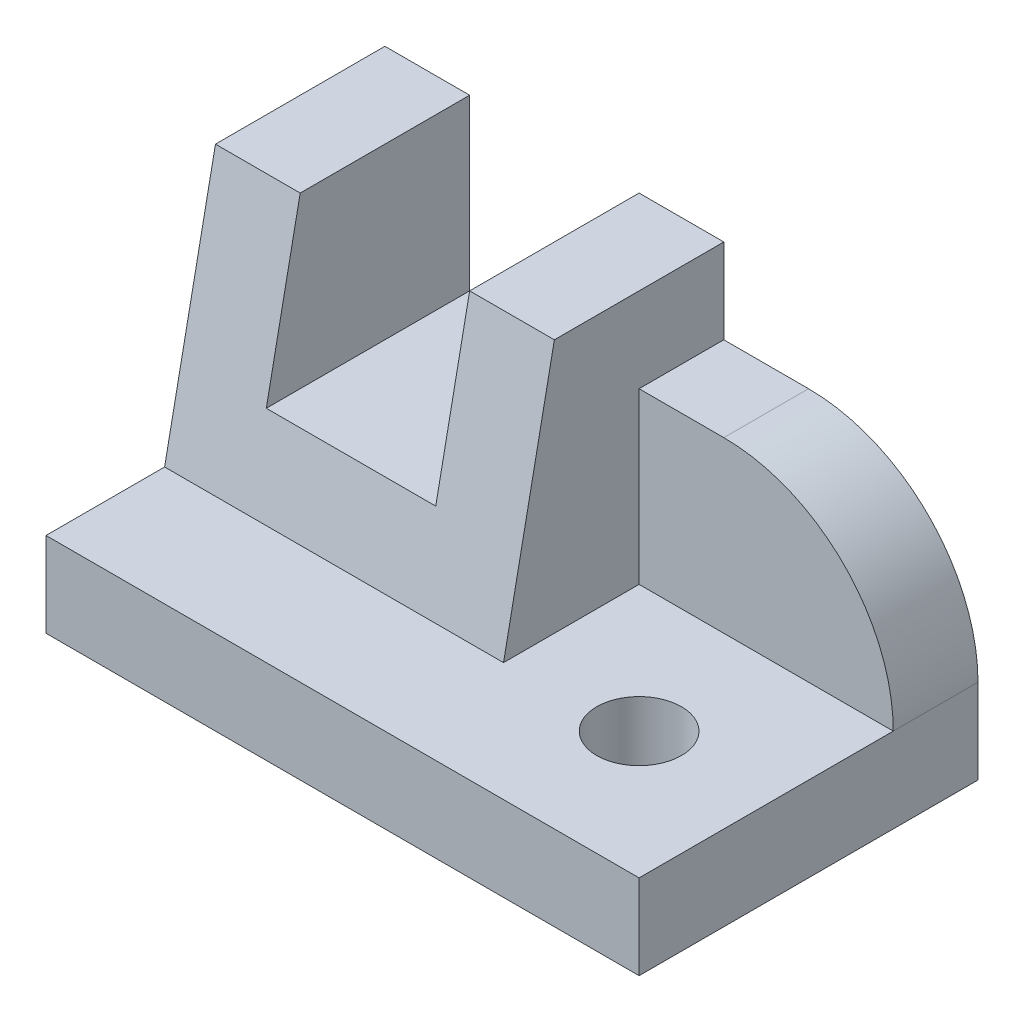
ISO-10303-21;
HEADER;
FILE_DESCRIPTION(('STEP AP214'),'2;1');
FILE_NAME('part.step','',(''),(''),'','','');
FILE_SCHEMA(('AUTOMOTIVE_DESIGN { 1 0 10303 214 1 1 1 1 }'));
ENDSEC;
DATA;
#1=APPLICATION_CONTEXT('core data for automotive mechanical design processes');
#2=APPLICATION_PROTOCOL_DEFINITION('international standard','automotive_design',2000,#1);
#3=PRODUCT_CONTEXT('',#1,'mechanical');
#4=PRODUCT('Part','Part','',(#3));
#5=PRODUCT_RELATED_PRODUCT_CATEGORY('part','',(#4));
#6=PRODUCT_DEFINITION_FORMATION('','',#4);
#7=PRODUCT_DEFINITION_CONTEXT('part definition',#1,'design');
#8=PRODUCT_DEFINITION('design','',#6,#7);
#9=PRODUCT_DEFINITION_SHAPE('','',#8);
#10=(LENGTH_UNIT() NAMED_UNIT(*) SI_UNIT(.MILLI.,.METRE.));
#11=(NAMED_UNIT(*) PLANE_ANGLE_UNIT() SI_UNIT($,.RADIAN.));
#12=(NAMED_UNIT(*) SI_UNIT($,.STERADIAN.) SOLID_ANGLE_UNIT());
#13=UNCERTAINTY_MEASURE_WITH_UNIT(LENGTH_MEASURE(1.E-05),#10,'distance_accuracy_value','');
#14=(GEOMETRIC_REPRESENTATION_CONTEXT(3) GLOBAL_UNCERTAINTY_ASSIGNED_CONTEXT((#13)) GLOBAL_UNIT_ASSIGNED_CONTEXT((#10,
#11,#12)) REPRESENTATION_CONTEXT('',''));
#15=CARTESIAN_POINT('',(0.,0.,0.));
#16=DIRECTION('',(0.,0.,1.));
#17=DIRECTION('',(1.,0.,0.));
#18=AXIS2_PLACEMENT_3D('',#15,#16,#17);
#19=CARTESIAN_POINT('',(40.,40.,-40.));
#20=DIRECTION('',(0.,-1.,0.));
#21=DIRECTION('',(0.,0.,-1.));
#22=AXIS2_PLACEMENT_3D('',#19,#20,#21);
#23=PLANE('',#22);
#24=DIRECTION('',(-1.,0.,0.));
#25=VECTOR('',#24,1.);
#26=CARTESIAN_POINT('',(40.,40.,-20.));
#27=LINE('',#26,#25);
#28=CARTESIAN_POINT('',(9.99999999999998,40.,-20.));
#29=VERTEX_POINT('',#28);
#30=CARTESIAN_POINT('',(0.,40.,-20.));
#31=VERTEX_POINT('',#30);
#32=EDGE_CURVE('E235',#29,#31,#27,.T.);
#33=ORIENTED_EDGE('',*,*,#32,.F.);
#34=DIRECTION('',(0.,0.,-1.));
#35=VECTOR('',#34,1.);
#36=CARTESIAN_POINT('',(9.99999999999998,40.,0.));
#37=LINE('',#36,#35);
#38=CARTESIAN_POINT('',(9.99999999999999,40.,-40.));
#39=VERTEX_POINT('',#38);
#40=EDGE_CURVE('E160',#29,#39,#37,.T.);
#41=ORIENTED_EDGE('',*,*,#40,.T.);
#42=DIRECTION('',(1.,0.,0.));
#43=VECTOR('',#42,1.);
#44=CARTESIAN_POINT('',(40.,40.,-40.));
#45=LINE('',#44,#43);
#46=CARTESIAN_POINT('',(0.,40.,-40.));
#47=VERTEX_POINT('',#46);
#48=EDGE_CURVE('E219',#47,#39,#45,.T.);
#49=ORIENTED_EDGE('',*,*,#48,.F.);
#50=DIRECTION('',(0.,0.,1.));
#51=VECTOR('',#50,1.);
#52=CARTESIAN_POINT('',(0.,40.,-40.));
#53=LINE('',#52,#51);
#54=EDGE_CURVE('E221',#47,#31,#53,.T.);
#55=ORIENTED_EDGE('',*,*,#54,.T.);
#56=EDGE_LOOP('',(#33,#41,#49,#55));
#57=FACE_BOUND('',#56,.T.);
#58=ADVANCED_FACE('F35',(#57),#23,.F.);
#59=CARTESIAN_POINT('',(40.,10.,-14.));
#60=DIRECTION('',(0.,0.196116135138184,0.98058067569092));
#61=DIRECTION('',(0.,-0.98058067569092,0.196116135138184));
#62=AXIS2_PLACEMENT_3D('',#59,#60,#61);
#63=PLANE('',#62);
#64=DIRECTION('',(0.,-0.98058067569092,0.196116135138184));
#65=VECTOR('',#64,1.);
#66=CARTESIAN_POINT('',(9.99999999999998,10.,-14.));
#67=LINE('',#66,#65);
#68=CARTESIAN_POINT('',(9.99999999999998,20.,-16.));
#69=VERTEX_POINT('',#68);
#70=EDGE_CURVE('E168',#29,#69,#67,.T.);
#71=ORIENTED_EDGE('',*,*,#70,.F.);
#72=ORIENTED_EDGE('',*,*,#32,.T.);
#73=DIRECTION('',(0.,0.98058067569092,-0.196116135138184));
#74=VECTOR('',#73,1.);
#75=CARTESIAN_POINT('',(0.,10.,-14.));
#76=LINE('',#75,#74);
#77=CARTESIAN_POINT('',(0.,10.,-14.));
#78=VERTEX_POINT('',#77);
#79=EDGE_CURVE('E224',#78,#31,#76,.T.);
#80=ORIENTED_EDGE('',*,*,#79,.F.);
#81=DIRECTION('',(-1.,0.,0.));
#82=VECTOR('',#81,1.);
#83=CARTESIAN_POINT('',(40.,10.,-14.));
#84=LINE('',#83,#82);
#85=CARTESIAN_POINT('',(40.,10.,-14.));
#86=VERTEX_POINT('',#85);
#87=EDGE_CURVE('E228',#86,#78,#84,.T.);
#88=ORIENTED_EDGE('',*,*,#87,.F.);
#89=DIRECTION('',(0.,0.98058067569092,-0.196116135138184));
#90=VECTOR('',#89,1.);
#91=CARTESIAN_POINT('',(40.,10.,-14.));
#92=LINE('',#91,#90);
#93=CARTESIAN_POINT('',(40.,40.,-20.));
#94=VERTEX_POINT('',#93);
#95=EDGE_CURVE('E225',#86,#94,#92,.T.);
#96=ORIENTED_EDGE('',*,*,#95,.T.);
#97=CARTESIAN_POINT('',(30.,40.,-20.));
#98=VERTEX_POINT('',#97);
#99=EDGE_CURVE('E231',#94,#98,#27,.T.);
#100=ORIENTED_EDGE('',*,*,#99,.T.);
#101=DIRECTION('',(0.,0.98058067569092,-0.196116135138184));
#102=VECTOR('',#101,1.);
#103=CARTESIAN_POINT('',(30.,10.,-14.));
#104=LINE('',#103,#102);
#105=CARTESIAN_POINT('',(30.,20.,-16.));
#106=VERTEX_POINT('',#105);
#107=EDGE_CURVE('E163',#106,#98,#104,.T.);
#108=ORIENTED_EDGE('',*,*,#107,.F.);
#109=DIRECTION('',(1.,0.,0.));
#110=VECTOR('',#109,1.);
#111=CARTESIAN_POINT('',(40.,20.,-16.));
#112=LINE('',#111,#110);
#113=EDGE_CURVE('E140',#69,#106,#112,.T.);
#114=ORIENTED_EDGE('',*,*,#113,.F.);
#115=EDGE_LOOP('',(#71,#72,#80,#88,#96,#100,#108,#114));
#116=FACE_BOUND('',#115,.T.);
#117=ADVANCED_FACE('F270',(#116),#63,.T.);
#118=CARTESIAN_POINT('',(0.,0.,0.));
#119=DIRECTION('',(1.,0.,0.));
#120=DIRECTION('',(0.,0.,-1.));
#121=AXIS2_PLACEMENT_3D('',#118,#119,#120);
#122=PLANE('',#121);
#123=DIRECTION('',(0.,1.,0.));
#124=VECTOR('',#123,1.);
#125=CARTESIAN_POINT('',(0.,40.,-40.));
#126=LINE('',#125,#124);
#127=CARTESIAN_POINT('',(0.,0.,-40.));
#128=VERTEX_POINT('',#127);
#129=EDGE_CURVE('E216',#128,#47,#126,.T.);
#130=ORIENTED_EDGE('',*,*,#129,.F.);
#131=DIRECTION('',(0.,0.,-1.));
#132=VECTOR('',#131,1.);
#133=CARTESIAN_POINT('',(0.,0.,-40.));
#134=LINE('',#133,#132);
#135=CARTESIAN_POINT('',(0.,0.,0.));
#136=VERTEX_POINT('',#135);
#137=EDGE_CURVE('E174',#136,#128,#134,.T.);
#138=ORIENTED_EDGE('',*,*,#137,.F.);
#139=DIRECTION('',(0.,1.,0.));
#140=VECTOR('',#139,1.);
#141=CARTESIAN_POINT('',(0.,0.,0.));
#142=LINE('',#141,#140);
#143=CARTESIAN_POINT('',(0.,10.,0.));
#144=VERTEX_POINT('',#143);
#145=EDGE_CURVE('E192',#136,#144,#142,.T.);
#146=ORIENTED_EDGE('',*,*,#145,.T.);
#147=DIRECTION('',(0.,0.,-1.));
#148=VECTOR('',#147,1.);
#149=CARTESIAN_POINT('',(0.,10.,-40.));
#150=LINE('',#149,#148);
#151=EDGE_CURVE('E186',#144,#78,#150,.T.);
#152=ORIENTED_EDGE('',*,*,#151,.T.);
#153=ORIENTED_EDGE('',*,*,#79,.T.);
#154=ORIENTED_EDGE('',*,*,#54,.F.);
#155=EDGE_LOOP('',(#130,#138,#146,#152,#153,#154));
#156=FACE_BOUND('',#155,.T.);
#157=ADVANCED_FACE('F273',(#156),#122,.F.);
#158=CARTESIAN_POINT('',(30.,40.,-40.));
#159=VERTEX_POINT('',#158);
#160=CARTESIAN_POINT('',(40.,40.,-40.));
#161=VERTEX_POINT('',#160);
#162=EDGE_CURVE('E218',#159,#161,#45,.T.);
#163=ORIENTED_EDGE('',*,*,#162,.F.);
#164=DIRECTION('',(0.,0.,-1.));
#165=VECTOR('',#164,1.);
#166=CARTESIAN_POINT('',(30.,40.,0.));
#167=LINE('',#166,#165);
#168=EDGE_CURVE('E144',#98,#159,#167,.T.);
#169=ORIENTED_EDGE('',*,*,#168,.F.);
#170=ORIENTED_EDGE('',*,*,#99,.F.);
#171=DIRECTION('',(0.,0.,1.));
#172=VECTOR('',#171,1.);
#173=CARTESIAN_POINT('',(40.,40.,-40.));
#174=LINE('',#173,#172);
#175=EDGE_CURVE('E195',#161,#94,#174,.T.);
#176=ORIENTED_EDGE('',*,*,#175,.F.);
#177=EDGE_LOOP('',(#163,#169,#170,#176));
#178=FACE_BOUND('',#177,.T.);
#179=ADVANCED_FACE('F267',(#178),#23,.F.);
#180=CARTESIAN_POINT('',(0.,0.,-40.));
#181=DIRECTION('',(0.,0.,1.));
#182=DIRECTION('',(0.,-1.,0.));
#183=AXIS2_PLACEMENT_3D('',#180,#181,#182);
#184=PLANE('',#183);
#185=DIRECTION('',(1.,0.,0.));
#186=VECTOR('',#185,1.);
#187=CARTESIAN_POINT('',(40.,30.,-40.));
#188=LINE('',#187,#186);
#189=CARTESIAN_POINT('',(40.,30.,-40.));
#190=VERTEX_POINT('',#189);
#191=CARTESIAN_POINT('',(50.,30.,-40.));
#192=VERTEX_POINT('',#191);
#193=EDGE_CURVE('E209',#190,#192,#188,.T.);
#194=ORIENTED_EDGE('',*,*,#193,.T.);
#195=CARTESIAN_POINT('',(50.,9.99999999999999,-40.));
#196=DIRECTION('',(0.,0.,1.));
#197=DIRECTION('',(0.,-1.,0.));
#198=AXIS2_PLACEMENT_3D('',#195,#196,#197);
#199=CIRCLE('',#198,20.);
#200=CARTESIAN_POINT('',(70.,10.,-40.));
#201=VERTEX_POINT('',#200);
#202=EDGE_CURVE('E50',#192,#201,#199,.F.);
#203=ORIENTED_EDGE('',*,*,#202,.T.);
#204=DIRECTION('',(0.,1.,0.));
#205=VECTOR('',#204,1.);
#206=CARTESIAN_POINT('',(70.,40.,-40.));
#207=LINE('',#206,#205);
#208=CARTESIAN_POINT('',(70.,0.,-40.));
#209=VERTEX_POINT('',#208);
#210=EDGE_CURVE('E211',#209,#201,#207,.T.);
#211=ORIENTED_EDGE('',*,*,#210,.F.);
#212=DIRECTION('',(1.,0.,0.));
#213=VECTOR('',#212,1.);
#214=CARTESIAN_POINT('',(70.,0.,-40.));
#215=LINE('',#214,#213);
#216=EDGE_CURVE('E178',#128,#209,#215,.T.);
#217=ORIENTED_EDGE('',*,*,#216,.F.);
#218=ORIENTED_EDGE('',*,*,#129,.T.);
#219=ORIENTED_EDGE('',*,*,#48,.T.);
#220=DIRECTION('',(0.,1.,0.));
#221=VECTOR('',#220,1.);
#222=CARTESIAN_POINT('',(9.99999999999999,20.,-40.));
#223=LINE('',#222,#221);
#224=CARTESIAN_POINT('',(9.99999999999999,20.,-40.));
#225=VERTEX_POINT('',#224);
#226=EDGE_CURVE('E155',#225,#39,#223,.T.);
#227=ORIENTED_EDGE('',*,*,#226,.F.);
#228=DIRECTION('',(-1.,0.,0.));
#229=VECTOR('',#228,1.);
#230=CARTESIAN_POINT('',(30.,20.,-40.));
#231=LINE('',#230,#229);
#232=CARTESIAN_POINT('',(30.,20.,-40.));
#233=VERTEX_POINT('',#232);
#234=EDGE_CURVE('E137',#233,#225,#231,.T.);
#235=ORIENTED_EDGE('',*,*,#234,.F.);
#236=DIRECTION('',(0.,-1.,0.));
#237=VECTOR('',#236,1.);
#238=CARTESIAN_POINT('',(30.,40.,-40.));
#239=LINE('',#238,#237);
#240=EDGE_CURVE('E147',#159,#233,#239,.T.);
#241=ORIENTED_EDGE('',*,*,#240,.F.);
#242=ORIENTED_EDGE('',*,*,#162,.T.);
#243=DIRECTION('',(0.,1.,0.));
#244=VECTOR('',#243,1.);
#245=CARTESIAN_POINT('',(40.,30.,-40.));
#246=LINE('',#245,#244);
#247=EDGE_CURVE('E205',#190,#161,#246,.T.);
#248=ORIENTED_EDGE('',*,*,#247,.F.);
#249=EDGE_LOOP('',(#194,#203,#211,#217,#218,#219,#227,#235,#241,#242,#248));
#250=FACE_BOUND('',#249,.T.);
#251=ADVANCED_FACE('F153',(#250),#184,.F.);
#252=CARTESIAN_POINT('',(70.,0.,0.));
#253=DIRECTION('',(-1.,0.,0.));
#254=DIRECTION('',(0.,0.,1.));
#255=AXIS2_PLACEMENT_3D('',#252,#253,#254);
#256=PLANE('',#255);
#257=ORIENTED_EDGE('',*,*,#210,.T.);
#258=DIRECTION('',(0.,0.,-1.));
#259=VECTOR('',#258,1.);
#260=CARTESIAN_POINT('',(70.,9.99999999999999,0.));
#261=LINE('',#260,#259);
#262=CARTESIAN_POINT('',(70.,10.,-30.));
#263=VERTEX_POINT('',#262);
#264=EDGE_CURVE('E43',#201,#263,#261,.F.);
#265=ORIENTED_EDGE('',*,*,#264,.T.);
#266=DIRECTION('',(0.,0.,1.));
#267=VECTOR('',#266,1.);
#268=CARTESIAN_POINT('',(70.,10.,0.));
#269=LINE('',#268,#267);
#270=CARTESIAN_POINT('',(70.,10.,0.));
#271=VERTEX_POINT('',#270);
#272=EDGE_CURVE('E175',#263,#271,#269,.T.);
#273=ORIENTED_EDGE('',*,*,#272,.T.);
#274=DIRECTION('',(0.,1.,0.));
#275=VECTOR('',#274,1.);
#276=CARTESIAN_POINT('',(70.,0.,0.));
#277=LINE('',#276,#275);
#278=CARTESIAN_POINT('',(70.,0.,0.));
#279=VERTEX_POINT('',#278);
#280=EDGE_CURVE('E183',#279,#271,#277,.T.);
#281=ORIENTED_EDGE('',*,*,#280,.F.);
#282=DIRECTION('',(0.,0.,1.));
#283=VECTOR('',#282,1.);
#284=CARTESIAN_POINT('',(70.,0.,0.));
#285=LINE('',#284,#283);
#286=EDGE_CURVE('E181',#209,#279,#285,.T.);
#287=ORIENTED_EDGE('',*,*,#286,.F.);
#288=EDGE_LOOP('',(#257,#265,#273,#281,#287));
#289=FACE_BOUND('',#288,.T.);
#290=ADVANCED_FACE('F245',(#289),#256,.F.);
#291=CARTESIAN_POINT('',(40.,30.,-30.));
#292=DIRECTION('',(0.,-1.,0.));
#293=DIRECTION('',(0.,0.,-1.));
#294=AXIS2_PLACEMENT_3D('',#291,#292,#293);
#295=PLANE('',#294);
#296=DIRECTION('',(1.,0.,0.));
#297=VECTOR('',#296,1.);
#298=CARTESIAN_POINT('',(40.,30.,-30.));
#299=LINE('',#298,#297);
#300=CARTESIAN_POINT('',(40.,30.,-30.));
#301=VERTEX_POINT('',#300);
#302=CARTESIAN_POINT('',(50.,30.,-30.));
#303=VERTEX_POINT('',#302);
#304=EDGE_CURVE('E212',#301,#303,#299,.T.);
#305=ORIENTED_EDGE('',*,*,#304,.T.);
#306=DIRECTION('',(0.,0.,-1.));
#307=VECTOR('',#306,1.);
#308=CARTESIAN_POINT('',(50.,30.,-30.));
#309=LINE('',#308,#307);
#310=EDGE_CURVE('E234',#303,#192,#309,.T.);
#311=ORIENTED_EDGE('',*,*,#310,.T.);
#312=ORIENTED_EDGE('',*,*,#193,.F.);
#313=DIRECTION('',(0.,0.,-1.));
#314=VECTOR('',#313,1.);
#315=CARTESIAN_POINT('',(40.,30.,-30.));
#316=LINE('',#315,#314);
#317=EDGE_CURVE('E202',#301,#190,#316,.T.);
#318=ORIENTED_EDGE('',*,*,#317,.F.);
#319=EDGE_LOOP('',(#305,#311,#312,#318));
#320=FACE_BOUND('',#319,.T.);
#321=ADVANCED_FACE('F259',(#320),#295,.F.);
#322=CARTESIAN_POINT('',(40.,10.,-30.));
#323=DIRECTION('',(0.,0.,-1.));
#324=DIRECTION('',(-1.,0.,0.));
#325=AXIS2_PLACEMENT_3D('',#322,#323,#324);
#326=PLANE('',#325);
#327=DIRECTION('',(1.,0.,0.));
#328=VECTOR('',#327,1.);
#329=CARTESIAN_POINT('',(40.,10.,-30.));
#330=LINE('',#329,#328);
#331=CARTESIAN_POINT('',(40.,10.,-30.));
#332=VERTEX_POINT('',#331);
#333=EDGE_CURVE('E208',#332,#263,#330,.T.);
#334=ORIENTED_EDGE('',*,*,#333,.T.);
#335=CARTESIAN_POINT('',(50.,9.99999999999999,-30.));
#336=DIRECTION('',(0.,0.,-1.));
#337=DIRECTION('',(-1.,0.,0.));
#338=AXIS2_PLACEMENT_3D('',#335,#336,#337);
#339=CIRCLE('',#338,20.);
#340=EDGE_CURVE('E11',#263,#303,#339,.F.);
#341=ORIENTED_EDGE('',*,*,#340,.T.);
#342=ORIENTED_EDGE('',*,*,#304,.F.);
#343=DIRECTION('',(0.,1.,0.));
#344=VECTOR('',#343,1.);
#345=CARTESIAN_POINT('',(40.,10.,-30.));
#346=LINE('',#345,#344);
#347=EDGE_CURVE('E199',#332,#301,#346,.T.);
#348=ORIENTED_EDGE('',*,*,#347,.F.);
#349=EDGE_LOOP('',(#334,#341,#342,#348));
#350=FACE_BOUND('',#349,.T.);
#351=ADVANCED_FACE('F252',(#350),#326,.F.);
#352=CARTESIAN_POINT('',(40.,0.,0.));
#353=DIRECTION('',(-1.,0.,0.));
#354=DIRECTION('',(0.,0.,1.));
#355=AXIS2_PLACEMENT_3D('',#352,#353,#354);
#356=PLANE('',#355);
#357=ORIENTED_EDGE('',*,*,#95,.F.);
#358=DIRECTION('',(0.,0.,-1.));
#359=VECTOR('',#358,1.);
#360=CARTESIAN_POINT('',(40.,10.,0.));
#361=LINE('',#360,#359);
#362=EDGE_CURVE('E197',#86,#332,#361,.T.);
#363=ORIENTED_EDGE('',*,*,#362,.T.);
#364=ORIENTED_EDGE('',*,*,#347,.T.);
#365=ORIENTED_EDGE('',*,*,#317,.T.);
#366=ORIENTED_EDGE('',*,*,#247,.T.);
#367=ORIENTED_EDGE('',*,*,#175,.T.);
#368=EDGE_LOOP('',(#357,#363,#364,#365,#366,#367));
#369=FACE_BOUND('',#368,.T.);
#370=ADVANCED_FACE('F264',(#369),#356,.F.);
#371=CARTESIAN_POINT('',(0.,10.,0.));
#372=DIRECTION('',(0.,1.,0.));
#373=DIRECTION('',(0.,0.,1.));
#374=AXIS2_PLACEMENT_3D('',#371,#372,#373);
#375=PLANE('',#374);
#376=CARTESIAN_POINT('',(55.,10.,-15.));
#377=DIRECTION('',(0.,1.,0.));
#378=DIRECTION('',(0.,0.,1.));
#379=AXIS2_PLACEMENT_3D('',#376,#377,#378);
#380=CIRCLE('',#379,4.99999999999998);
#381=CARTESIAN_POINT('',(55.,10.,-10.));
#382=VERTEX_POINT('',#381);
#383=EDGE_CURVE('E151',#382,#382,#380,.T.);
#384=ORIENTED_EDGE('',*,*,#383,.F.);
#385=EDGE_LOOP('',(#384));
#386=FACE_BOUND('',#385,.T.);
#387=ORIENTED_EDGE('',*,*,#333,.F.);
#388=ORIENTED_EDGE('',*,*,#362,.F.);
#389=ORIENTED_EDGE('',*,*,#87,.T.);
#390=ORIENTED_EDGE('',*,*,#151,.F.);
#391=DIRECTION('',(-1.,0.,0.));
#392=VECTOR('',#391,1.);
#393=CARTESIAN_POINT('',(0.,10.,0.));
#394=LINE('',#393,#392);
#395=EDGE_CURVE('E170',#271,#144,#394,.T.);
#396=ORIENTED_EDGE('',*,*,#395,.F.);
#397=ORIENTED_EDGE('',*,*,#272,.F.);
#398=EDGE_LOOP('',(#387,#388,#389,#390,#396,#397));
#399=FACE_BOUND('',#398,.T.);
#400=ADVANCED_FACE('F256',(#386,#399),#375,.T.);
#401=CARTESIAN_POINT('',(0.,0.,0.));
#402=DIRECTION('',(0.,0.,-1.));
#403=DIRECTION('',(-1.,0.,0.));
#404=AXIS2_PLACEMENT_3D('',#401,#402,#403);
#405=PLANE('',#404);
#406=ORIENTED_EDGE('',*,*,#395,.T.);
#407=ORIENTED_EDGE('',*,*,#145,.F.);
#408=DIRECTION('',(-1.,0.,0.));
#409=VECTOR('',#408,1.);
#410=CARTESIAN_POINT('',(0.,0.,0.));
#411=LINE('',#410,#409);
#412=EDGE_CURVE('E171',#279,#136,#411,.T.);
#413=ORIENTED_EDGE('',*,*,#412,.F.);
#414=ORIENTED_EDGE('',*,*,#280,.T.);
#415=EDGE_LOOP('',(#406,#407,#413,#414));
#416=FACE_BOUND('',#415,.T.);
#417=ADVANCED_FACE('F278',(#416),#405,.F.);
#418=CARTESIAN_POINT('',(0.,0.,0.));
#419=DIRECTION('',(0.,1.,0.));
#420=DIRECTION('',(0.,0.,1.));
#421=AXIS2_PLACEMENT_3D('',#418,#419,#420);
#422=PLANE('',#421);
#423=CARTESIAN_POINT('',(55.,0.,-15.));
#424=DIRECTION('',(0.,-1.,0.));
#425=DIRECTION('',(0.,0.,-1.));
#426=AXIS2_PLACEMENT_3D('',#423,#424,#425);
#427=CIRCLE('',#426,4.99999999999998);
#428=CARTESIAN_POINT('',(55.,0.,-20.));
#429=VERTEX_POINT('',#428);
#430=EDGE_CURVE('E240',#429,#429,#427,.T.);
#431=ORIENTED_EDGE('',*,*,#430,.F.);
#432=EDGE_LOOP('',(#431));
#433=FACE_BOUND('',#432,.T.);
#434=ORIENTED_EDGE('',*,*,#412,.T.);
#435=ORIENTED_EDGE('',*,*,#137,.T.);
#436=ORIENTED_EDGE('',*,*,#216,.T.);
#437=ORIENTED_EDGE('',*,*,#286,.T.);
#438=EDGE_LOOP('',(#434,#435,#436,#437));
#439=FACE_BOUND('',#438,.T.);
#440=ADVANCED_FACE('F280',(#433,#439),#422,.F.);
#441=CARTESIAN_POINT('',(9.99999999999998,20.,0.));
#442=DIRECTION('',(-1.,0.,0.));
#443=DIRECTION('',(0.,0.,1.));
#444=AXIS2_PLACEMENT_3D('',#441,#442,#443);
#445=PLANE('',#444);
#446=ORIENTED_EDGE('',*,*,#70,.T.);
#447=DIRECTION('',(0.,0.,-1.));
#448=VECTOR('',#447,1.);
#449=CARTESIAN_POINT('',(9.99999999999998,20.,0.));
#450=LINE('',#449,#448);
#451=EDGE_CURVE('E143',#69,#225,#450,.T.);
#452=ORIENTED_EDGE('',*,*,#451,.T.);
#453=ORIENTED_EDGE('',*,*,#226,.T.);
#454=ORIENTED_EDGE('',*,*,#40,.F.);
#455=EDGE_LOOP('',(#446,#452,#453,#454));
#456=FACE_BOUND('',#455,.T.);
#457=ADVANCED_FACE('F286',(#456),#445,.F.);
#458=CARTESIAN_POINT('',(30.,20.,0.));
#459=DIRECTION('',(0.,-1.,0.));
#460=DIRECTION('',(0.,0.,-1.));
#461=AXIS2_PLACEMENT_3D('',#458,#459,#460);
#462=PLANE('',#461);
#463=ORIENTED_EDGE('',*,*,#113,.T.);
#464=DIRECTION('',(0.,0.,-1.));
#465=VECTOR('',#464,1.);
#466=CARTESIAN_POINT('',(30.,20.,0.));
#467=LINE('',#466,#465);
#468=EDGE_CURVE('E132',#106,#233,#467,.T.);
#469=ORIENTED_EDGE('',*,*,#468,.T.);
#470=ORIENTED_EDGE('',*,*,#234,.T.);
#471=ORIENTED_EDGE('',*,*,#451,.F.);
#472=EDGE_LOOP('',(#463,#469,#470,#471));
#473=FACE_BOUND('',#472,.T.);
#474=ADVANCED_FACE('F134',(#473),#462,.F.);
#475=CARTESIAN_POINT('',(30.,40.,0.));
#476=DIRECTION('',(1.,0.,0.));
#477=DIRECTION('',(0.,0.,-1.));
#478=AXIS2_PLACEMENT_3D('',#475,#476,#477);
#479=PLANE('',#478);
#480=ORIENTED_EDGE('',*,*,#107,.T.);
#481=ORIENTED_EDGE('',*,*,#168,.T.);
#482=ORIENTED_EDGE('',*,*,#240,.T.);
#483=ORIENTED_EDGE('',*,*,#468,.F.);
#484=EDGE_LOOP('',(#480,#481,#482,#483));
#485=FACE_BOUND('',#484,.T.);
#486=ADVANCED_FACE('F148',(#485),#479,.F.);
#487=CARTESIAN_POINT('',(55.,0.,-15.));
#488=DIRECTION('',(0.,-1.,0.));
#489=DIRECTION('',(0.,0.,-1.));
#490=AXIS2_PLACEMENT_3D('',#487,#488,#489);
#491=CYLINDRICAL_SURFACE('',#490,4.99999999999998);
#492=ORIENTED_EDGE('',*,*,#383,.T.);
#493=EDGE_LOOP('',(#492));
#494=FACE_BOUND('',#493,.T.);
#495=ORIENTED_EDGE('',*,*,#430,.T.);
#496=EDGE_LOOP('',(#495));
#497=FACE_BOUND('',#496,.T.);
#498=ADVANCED_FACE('F346',(#494,#497),#491,.F.);
#499=CARTESIAN_POINT('',(50.,9.99999999999999,-30.));
#500=DIRECTION('',(0.,0.,-1.));
#501=DIRECTION('',(-1.,0.,0.));
#502=AXIS2_PLACEMENT_3D('',#499,#500,#501);
#503=CYLINDRICAL_SURFACE('',#502,20.);
#504=ORIENTED_EDGE('',*,*,#340,.F.);
#505=ORIENTED_EDGE('',*,*,#264,.F.);
#506=ORIENTED_EDGE('',*,*,#202,.F.);
#507=ORIENTED_EDGE('',*,*,#310,.F.);
#508=EDGE_LOOP('',(#504,#505,#506,#507));
#509=FACE_BOUND('',#508,.T.);
#510=ADVANCED_FACE('F37',(#509),#503,.T.);
#511=CLOSED_SHELL('',(#58,#117,#157,#179,#251,#290,#321,#351,#370,#400,#417,#440,#457,#474,#486,
#498,#510));
#512=MANIFOLD_SOLID_BREP('B2',#511);
#513=ADVANCED_BREP_SHAPE_REPRESENTATION('',(#18,#512),#14);
#514=SHAPE_DEFINITION_REPRESENTATION(#9,#513);
ENDSEC;
END-ISO-10303-21;
